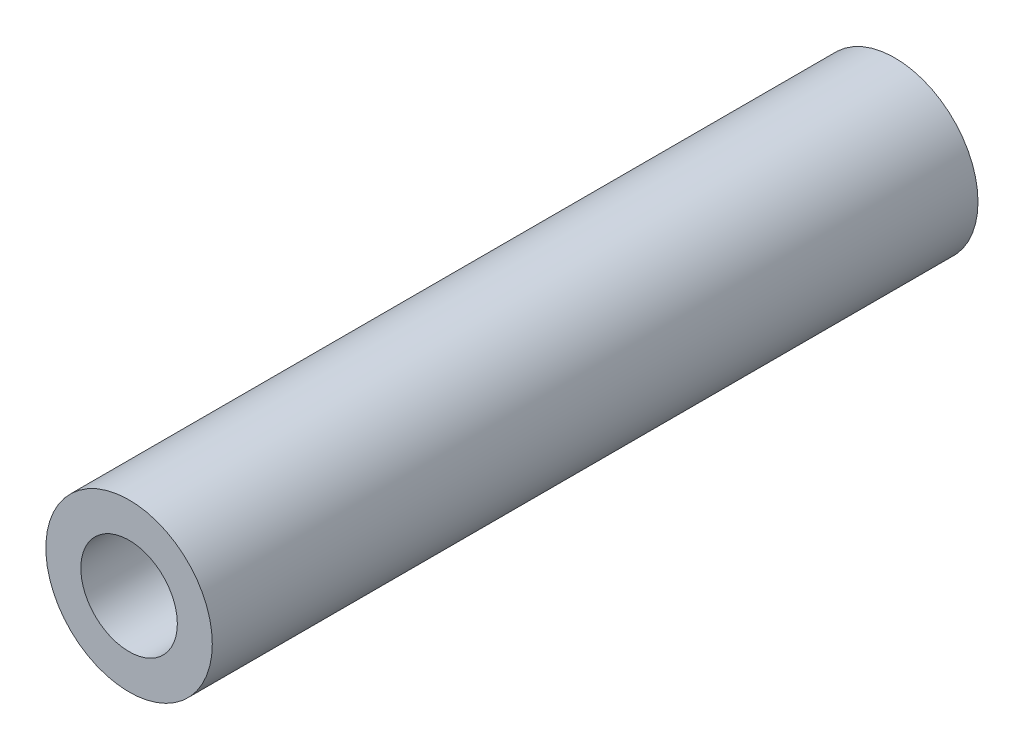
ISO-10303-21;
HEADER;
FILE_DESCRIPTION(('STEP AP214'),'2;1');
FILE_NAME('part.step','',(''),(''),'','','');
FILE_SCHEMA(('AUTOMOTIVE_DESIGN { 1 0 10303 214 1 1 1 1 }'));
ENDSEC;
DATA;
#1=APPLICATION_CONTEXT('core data for automotive mechanical design processes');
#2=APPLICATION_PROTOCOL_DEFINITION('international standard','automotive_design',2000,#1);
#3=PRODUCT_CONTEXT('',#1,'mechanical');
#4=PRODUCT('Part','Part','',(#3));
#5=PRODUCT_RELATED_PRODUCT_CATEGORY('part','',(#4));
#6=PRODUCT_DEFINITION_FORMATION('','',#4);
#7=PRODUCT_DEFINITION_CONTEXT('part definition',#1,'design');
#8=PRODUCT_DEFINITION('design','',#6,#7);
#9=PRODUCT_DEFINITION_SHAPE('','',#8);
#10=(LENGTH_UNIT() NAMED_UNIT(*) SI_UNIT(.MILLI.,.METRE.));
#11=(NAMED_UNIT(*) PLANE_ANGLE_UNIT() SI_UNIT($,.RADIAN.));
#12=(NAMED_UNIT(*) SI_UNIT($,.STERADIAN.) SOLID_ANGLE_UNIT());
#13=UNCERTAINTY_MEASURE_WITH_UNIT(LENGTH_MEASURE(1.E-05),#10,'distance_accuracy_value','');
#14=(GEOMETRIC_REPRESENTATION_CONTEXT(3) GLOBAL_UNCERTAINTY_ASSIGNED_CONTEXT((#13)) GLOBAL_UNIT_ASSIGNED_CONTEXT((#10,
#11,#12)) REPRESENTATION_CONTEXT('',''));
#15=CARTESIAN_POINT('',(0.,0.,0.));
#16=DIRECTION('',(0.,0.,1.));
#17=DIRECTION('',(1.,0.,0.));
#18=AXIS2_PLACEMENT_3D('',#15,#16,#17);
#19=CARTESIAN_POINT('',(0.,0.,23.));
#20=DIRECTION('',(0.,0.,1.));
#21=DIRECTION('',(1.,0.,0.));
#22=AXIS2_PLACEMENT_3D('',#19,#20,#21);
#23=PLANE('',#22);
#24=CARTESIAN_POINT('',(0.,0.,23.));
#25=DIRECTION('',(0.,0.,1.));
#26=DIRECTION('',(1.,0.,0.));
#27=AXIS2_PLACEMENT_3D('',#24,#25,#26);
#28=CIRCLE('',#27,2.5);
#29=CARTESIAN_POINT('',(2.5,0.,23.));
#30=VERTEX_POINT('',#29);
#31=EDGE_CURVE('E10',#30,#30,#28,.T.);
#32=ORIENTED_EDGE('',*,*,#31,.T.);
#33=EDGE_LOOP('',(#32));
#34=FACE_BOUND('',#33,.T.);
#35=CARTESIAN_POINT('',(0.,0.,23.));
#36=DIRECTION('',(0.,0.,1.));
#37=DIRECTION('',(1.,0.,0.));
#38=AXIS2_PLACEMENT_3D('',#35,#36,#37);
#39=CIRCLE('',#38,1.45);
#40=CARTESIAN_POINT('',(1.45,0.,23.));
#41=VERTEX_POINT('',#40);
#42=EDGE_CURVE('E50',#41,#41,#39,.T.);
#43=ORIENTED_EDGE('',*,*,#42,.F.);
#44=EDGE_LOOP('',(#43));
#45=FACE_BOUND('',#44,.T.);
#46=ADVANCED_FACE('F37',(#34,#45),#23,.T.);
#47=CARTESIAN_POINT('',(0.,0.,0.));
#48=DIRECTION('',(0.,0.,1.));
#49=DIRECTION('',(1.,0.,0.));
#50=AXIS2_PLACEMENT_3D('',#47,#48,#49);
#51=PLANE('',#50);
#52=CARTESIAN_POINT('',(0.,0.,0.));
#53=DIRECTION('',(0.,0.,1.));
#54=DIRECTION('',(1.,0.,0.));
#55=AXIS2_PLACEMENT_3D('',#52,#53,#54);
#56=CIRCLE('',#55,2.5);
#57=CARTESIAN_POINT('',(2.5,0.,0.));
#58=VERTEX_POINT('',#57);
#59=EDGE_CURVE('E41',#58,#58,#56,.T.);
#60=ORIENTED_EDGE('',*,*,#59,.F.);
#61=EDGE_LOOP('',(#60));
#62=FACE_BOUND('',#61,.T.);
#63=CARTESIAN_POINT('',(0.,0.,0.));
#64=DIRECTION('',(0.,0.,1.));
#65=DIRECTION('',(1.,0.,0.));
#66=AXIS2_PLACEMENT_3D('',#63,#64,#65);
#67=CIRCLE('',#66,1.45);
#68=CARTESIAN_POINT('',(1.45,0.,0.));
#69=VERTEX_POINT('',#68);
#70=EDGE_CURVE('E52',#69,#69,#67,.T.);
#71=ORIENTED_EDGE('',*,*,#70,.T.);
#72=EDGE_LOOP('',(#71));
#73=FACE_BOUND('',#72,.T.);
#74=ADVANCED_FACE('F64',(#62,#73),#51,.F.);
#75=CARTESIAN_POINT('',(0.,0.,23.));
#76=DIRECTION('',(0.,0.,-1.));
#77=DIRECTION('',(-1.,0.,0.));
#78=AXIS2_PLACEMENT_3D('',#75,#76,#77);
#79=CYLINDRICAL_SURFACE('',#78,2.5);
#80=ORIENTED_EDGE('',*,*,#31,.F.);
#81=EDGE_LOOP('',(#80));
#82=FACE_BOUND('',#81,.T.);
#83=ORIENTED_EDGE('',*,*,#59,.T.);
#84=EDGE_LOOP('',(#83));
#85=FACE_BOUND('',#84,.T.);
#86=ADVANCED_FACE('F39',(#82,#85),#79,.T.);
#87=CARTESIAN_POINT('',(0.,0.,23.));
#88=DIRECTION('',(0.,0.,-1.));
#89=DIRECTION('',(-1.,0.,0.));
#90=AXIS2_PLACEMENT_3D('',#87,#88,#89);
#91=CYLINDRICAL_SURFACE('',#90,1.45);
#92=ORIENTED_EDGE('',*,*,#42,.T.);
#93=EDGE_LOOP('',(#92));
#94=FACE_BOUND('',#93,.T.);
#95=ORIENTED_EDGE('',*,*,#70,.F.);
#96=EDGE_LOOP('',(#95));
#97=FACE_BOUND('',#96,.T.);
#98=ADVANCED_FACE('F60',(#94,#97),#91,.F.);
#99=CLOSED_SHELL('',(#46,#74,#86,#98));
#100=MANIFOLD_SOLID_BREP('B2',#99);
#101=ADVANCED_BREP_SHAPE_REPRESENTATION('',(#18,#100),#14);
#102=SHAPE_DEFINITION_REPRESENTATION(#9,#101);
ENDSEC;
END-ISO-10303-21;
